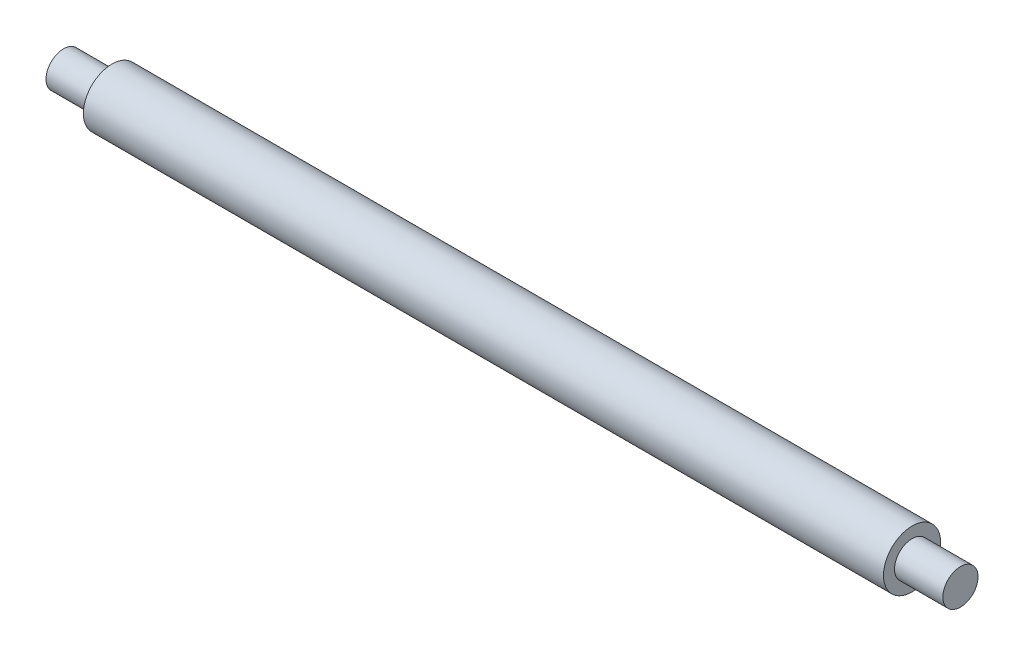
ISO-10303-21;
HEADER;
FILE_DESCRIPTION(('STEP AP214'),'2;1');
FILE_NAME('part.step','',(''),(''),'','','');
FILE_SCHEMA(('AUTOMOTIVE_DESIGN { 1 0 10303 214 1 1 1 1 }'));
ENDSEC;
DATA;
#1=APPLICATION_CONTEXT('core data for automotive mechanical design processes');
#2=APPLICATION_PROTOCOL_DEFINITION('international standard','automotive_design',2000,#1);
#3=PRODUCT_CONTEXT('',#1,'mechanical');
#4=PRODUCT('Part','Part','',(#3));
#5=PRODUCT_RELATED_PRODUCT_CATEGORY('part','',(#4));
#6=PRODUCT_DEFINITION_FORMATION('','',#4);
#7=PRODUCT_DEFINITION_CONTEXT('part definition',#1,'design');
#8=PRODUCT_DEFINITION('design','',#6,#7);
#9=PRODUCT_DEFINITION_SHAPE('','',#8);
#10=(LENGTH_UNIT() NAMED_UNIT(*) SI_UNIT(.MILLI.,.METRE.));
#11=(NAMED_UNIT(*) PLANE_ANGLE_UNIT() SI_UNIT($,.RADIAN.));
#12=(NAMED_UNIT(*) SI_UNIT($,.STERADIAN.) SOLID_ANGLE_UNIT());
#13=UNCERTAINTY_MEASURE_WITH_UNIT(LENGTH_MEASURE(1.E-05),#10,'distance_accuracy_value','');
#14=(GEOMETRIC_REPRESENTATION_CONTEXT(3) GLOBAL_UNCERTAINTY_ASSIGNED_CONTEXT((#13)) GLOBAL_UNIT_ASSIGNED_CONTEXT((#10,
#11,#12)) REPRESENTATION_CONTEXT('',''));
#15=CARTESIAN_POINT('',(0.,0.,0.));
#16=DIRECTION('',(0.,0.,1.));
#17=DIRECTION('',(1.,0.,0.));
#18=AXIS2_PLACEMENT_3D('',#15,#16,#17);
#19=CARTESIAN_POINT('',(-148.262295081967,0.,0.));
#20=DIRECTION('',(1.,0.,0.));
#21=DIRECTION('',(0.,0.,-1.));
#22=AXIS2_PLACEMENT_3D('',#19,#20,#21);
#23=PLANE('',#22);
#24=CARTESIAN_POINT('',(-148.262295081967,0.,0.));
#25=DIRECTION('',(-1.,0.,0.));
#26=DIRECTION('',(0.,0.,1.));
#27=AXIS2_PLACEMENT_3D('',#24,#25,#26);
#28=CIRCLE('',#27,4.);
#29=CARTESIAN_POINT('',(-148.262295081967,0.,4.));
#30=VERTEX_POINT('',#29);
#31=EDGE_CURVE('E10',#30,#30,#28,.T.);
#32=ORIENTED_EDGE('',*,*,#31,.T.);
#33=EDGE_LOOP('',(#32));
#34=FACE_BOUND('',#33,.T.);
#35=ADVANCED_FACE('F37',(#34),#23,.F.);
#36=CARTESIAN_POINT('',(-165.129093550009,0.,0.));
#37=DIRECTION('',(-1.,0.,0.));
#38=DIRECTION('',(0.,0.,1.));
#39=AXIS2_PLACEMENT_3D('',#36,#37,#38);
#40=CYLINDRICAL_SURFACE('',#39,4.);
#41=ORIENTED_EDGE('',*,*,#31,.F.);
#42=EDGE_LOOP('',(#41));
#43=FACE_BOUND('',#42,.T.);
#44=CARTESIAN_POINT('',(-137.262295081967,0.,0.));
#45=DIRECTION('',(-1.,0.,0.));
#46=DIRECTION('',(0.,0.,1.));
#47=AXIS2_PLACEMENT_3D('',#44,#45,#46);
#48=CIRCLE('',#47,4.);
#49=CARTESIAN_POINT('',(-137.262295081967,0.,4.));
#50=VERTEX_POINT('',#49);
#51=EDGE_CURVE('E44',#50,#50,#48,.T.);
#52=ORIENTED_EDGE('',*,*,#51,.T.);
#53=EDGE_LOOP('',(#52));
#54=FACE_BOUND('',#53,.T.);
#55=ADVANCED_FACE('F81',(#43,#54),#40,.T.);
#56=CARTESIAN_POINT('',(-137.262295081967,4.,0.));
#57=DIRECTION('',(1.,0.,0.));
#58=DIRECTION('',(0.,0.,-1.));
#59=AXIS2_PLACEMENT_3D('',#56,#57,#58);
#60=PLANE('',#59);
#61=ORIENTED_EDGE('',*,*,#51,.F.);
#62=EDGE_LOOP('',(#61));
#63=FACE_BOUND('',#62,.T.);
#64=CARTESIAN_POINT('',(-137.262295081967,0.,0.));
#65=DIRECTION('',(-1.,0.,0.));
#66=DIRECTION('',(0.,0.,1.));
#67=AXIS2_PLACEMENT_3D('',#64,#65,#66);
#68=CIRCLE('',#67,6.5);
#69=CARTESIAN_POINT('',(-137.262295081967,0.,6.5));
#70=VERTEX_POINT('',#69);
#71=EDGE_CURVE('E49',#70,#70,#68,.T.);
#72=ORIENTED_EDGE('',*,*,#71,.T.);
#73=EDGE_LOOP('',(#72));
#74=FACE_BOUND('',#73,.T.);
#75=ADVANCED_FACE('F85',(#63,#74),#60,.F.);
#76=CARTESIAN_POINT('',(-165.129093550009,0.,0.));
#77=DIRECTION('',(-1.,0.,0.));
#78=DIRECTION('',(0.,0.,1.));
#79=AXIS2_PLACEMENT_3D('',#76,#77,#78);
#80=CYLINDRICAL_SURFACE('',#79,6.5);
#81=ORIENTED_EDGE('',*,*,#71,.F.);
#82=EDGE_LOOP('',(#81));
#83=FACE_BOUND('',#82,.T.);
#84=CARTESIAN_POINT('',(44.7377049180328,0.,0.));
#85=DIRECTION('',(-1.,0.,0.));
#86=DIRECTION('',(0.,0.,1.));
#87=AXIS2_PLACEMENT_3D('',#84,#85,#86);
#88=CIRCLE('',#87,6.5);
#89=CARTESIAN_POINT('',(44.7377049180328,0.,6.5));
#90=VERTEX_POINT('',#89);
#91=EDGE_CURVE('E54',#90,#90,#88,.T.);
#92=ORIENTED_EDGE('',*,*,#91,.T.);
#93=EDGE_LOOP('',(#92));
#94=FACE_BOUND('',#93,.T.);
#95=ADVANCED_FACE('F90',(#83,#94),#80,.T.);
#96=CARTESIAN_POINT('',(44.7377049180328,6.5,0.));
#97=DIRECTION('',(-1.,0.,0.));
#98=DIRECTION('',(0.,0.,1.));
#99=AXIS2_PLACEMENT_3D('',#96,#97,#98);
#100=PLANE('',#99);
#101=ORIENTED_EDGE('',*,*,#91,.F.);
#102=EDGE_LOOP('',(#101));
#103=FACE_BOUND('',#102,.T.);
#104=CARTESIAN_POINT('',(44.7377049180328,0.,0.));
#105=DIRECTION('',(-1.,0.,0.));
#106=DIRECTION('',(0.,0.,1.));
#107=AXIS2_PLACEMENT_3D('',#104,#105,#106);
#108=CIRCLE('',#107,4.);
#109=CARTESIAN_POINT('',(44.7377049180328,0.,4.));
#110=VERTEX_POINT('',#109);
#111=EDGE_CURVE('E60',#110,#110,#108,.T.);
#112=ORIENTED_EDGE('',*,*,#111,.T.);
#113=EDGE_LOOP('',(#112));
#114=FACE_BOUND('',#113,.T.);
#115=ADVANCED_FACE('F77',(#103,#114),#100,.F.);
#116=CARTESIAN_POINT('',(-165.129093550009,0.,0.));
#117=DIRECTION('',(-1.,0.,0.));
#118=DIRECTION('',(0.,0.,1.));
#119=AXIS2_PLACEMENT_3D('',#116,#117,#118);
#120=CYLINDRICAL_SURFACE('',#119,4.);
#121=ORIENTED_EDGE('',*,*,#111,.F.);
#122=EDGE_LOOP('',(#121));
#123=FACE_BOUND('',#122,.T.);
#124=CARTESIAN_POINT('',(55.7377049180328,0.,0.));
#125=DIRECTION('',(-1.,0.,0.));
#126=DIRECTION('',(0.,0.,1.));
#127=AXIS2_PLACEMENT_3D('',#124,#125,#126);
#128=CIRCLE('',#127,4.);
#129=CARTESIAN_POINT('',(55.7377049180328,0.,4.));
#130=VERTEX_POINT('',#129);
#131=EDGE_CURVE('E64',#130,#130,#128,.T.);
#132=ORIENTED_EDGE('',*,*,#131,.T.);
#133=EDGE_LOOP('',(#132));
#134=FACE_BOUND('',#133,.T.);
#135=ADVANCED_FACE('F69',(#123,#134),#120,.T.);
#136=CARTESIAN_POINT('',(55.7377049180328,4.,0.));
#137=DIRECTION('',(-1.,0.,0.));
#138=DIRECTION('',(0.,0.,1.));
#139=AXIS2_PLACEMENT_3D('',#136,#137,#138);
#140=PLANE('',#139);
#141=ORIENTED_EDGE('',*,*,#131,.F.);
#142=EDGE_LOOP('',(#141));
#143=FACE_BOUND('',#142,.T.);
#144=ADVANCED_FACE('F71',(#143),#140,.F.);
#145=CLOSED_SHELL('',(#35,#55,#75,#95,#115,#135,#144));
#146=MANIFOLD_SOLID_BREP('B2',#145);
#147=ADVANCED_BREP_SHAPE_REPRESENTATION('',(#18,#146),#14);
#148=SHAPE_DEFINITION_REPRESENTATION(#9,#147);
ENDSEC;
END-ISO-10303-21;
